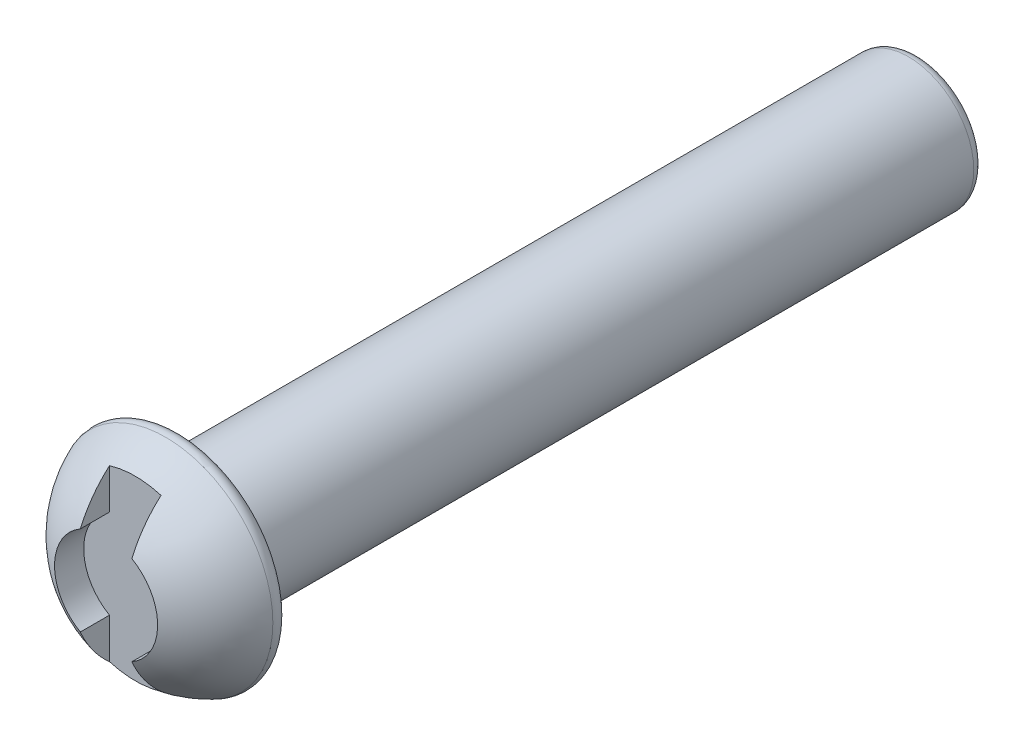
ISO-10303-21;
HEADER;
FILE_DESCRIPTION(('STEP AP214'),'2;1');
FILE_NAME('part.step','',(''),(''),'','','');
FILE_SCHEMA(('AUTOMOTIVE_DESIGN { 1 0 10303 214 1 1 1 1 }'));
ENDSEC;
DATA;
#1=APPLICATION_CONTEXT('core data for automotive mechanical design processes');
#2=APPLICATION_PROTOCOL_DEFINITION('international standard','automotive_design',2000,#1);
#3=PRODUCT_CONTEXT('',#1,'mechanical');
#4=PRODUCT('Part','Part','',(#3));
#5=PRODUCT_RELATED_PRODUCT_CATEGORY('part','',(#4));
#6=PRODUCT_DEFINITION_FORMATION('','',#4);
#7=PRODUCT_DEFINITION_CONTEXT('part definition',#1,'design');
#8=PRODUCT_DEFINITION('design','',#6,#7);
#9=PRODUCT_DEFINITION_SHAPE('','',#8);
#10=(LENGTH_UNIT() NAMED_UNIT(*) SI_UNIT(.MILLI.,.METRE.));
#11=(NAMED_UNIT(*) PLANE_ANGLE_UNIT() SI_UNIT($,.RADIAN.));
#12=(NAMED_UNIT(*) SI_UNIT($,.STERADIAN.) SOLID_ANGLE_UNIT());
#13=UNCERTAINTY_MEASURE_WITH_UNIT(LENGTH_MEASURE(1.E-05),#10,'distance_accuracy_value','');
#14=(GEOMETRIC_REPRESENTATION_CONTEXT(3) GLOBAL_UNCERTAINTY_ASSIGNED_CONTEXT((#13)) GLOBAL_UNIT_ASSIGNED_CONTEXT((#10,
#11,#12)) REPRESENTATION_CONTEXT('',''));
#15=CARTESIAN_POINT('',(0.,0.,0.));
#16=DIRECTION('',(0.,0.,1.));
#17=DIRECTION('',(1.,0.,0.));
#18=AXIS2_PLACEMENT_3D('',#15,#16,#17);
#19=CARTESIAN_POINT('',(0.,0.,-8.4388));
#20=DIRECTION('',(0.,0.,1.));
#21=DIRECTION('',(0.,1.,0.));
#22=AXIS2_PLACEMENT_3D('',#19,#20,#21);
#23=SPHERICAL_SURFACE('',#22,8.4388);
#24=CARTESIAN_POINT('',(-1.875,0.,-8.4388));
#25=DIRECTION('',(-1.,0.,0.));
#26=DIRECTION('',(0.,-1.,0.));
#27=AXIS2_PLACEMENT_3D('',#24,#25,#26);
#28=CIRCLE('',#27,8.22786244658963);
#29=CARTESIAN_POINT('',(-1.875,-6.17391083511902,-3.));
#30=VERTEX_POINT('',#29);
#31=CARTESIAN_POINT('',(-1.875,-3.24759526419164,-0.878982182089307));
#32=VERTEX_POINT('',#31);
#33=EDGE_CURVE('E144',#30,#32,#28,.T.);
#34=ORIENTED_EDGE('',*,*,#33,.T.);
#35=CARTESIAN_POINT('',(0.,0.,-0.878982182089307));
#36=DIRECTION('',(0.,0.,-1.));
#37=DIRECTION('',(-1.,0.,0.));
#38=AXIS2_PLACEMENT_3D('',#35,#36,#37);
#39=CIRCLE('',#38,3.75);
#40=CARTESIAN_POINT('',(-1.875,3.24759526419164,-0.878982182089307));
#41=VERTEX_POINT('',#40);
#42=EDGE_CURVE('E11',#32,#41,#39,.T.);
#43=ORIENTED_EDGE('',*,*,#42,.T.);
#44=CARTESIAN_POINT('',(-1.875,0.,-8.4388));
#45=DIRECTION('',(-1.,0.,0.));
#46=DIRECTION('',(0.,-1.,0.));
#47=AXIS2_PLACEMENT_3D('',#44,#45,#46);
#48=CIRCLE('',#47,8.22786244658963);
#49=CARTESIAN_POINT('',(-1.875,6.17391083511902,-3.));
#50=VERTEX_POINT('',#49);
#51=EDGE_CURVE('E41',#41,#50,#48,.T.);
#52=ORIENTED_EDGE('',*,*,#51,.T.);
#53=CARTESIAN_POINT('',(0.,0.,-3.));
#54=DIRECTION('',(0.,0.,1.));
#55=DIRECTION('',(1.,0.,0.));
#56=AXIS2_PLACEMENT_3D('',#53,#54,#55);
#57=CIRCLE('',#56,6.45234840968775);
#58=CARTESIAN_POINT('',(1.875,6.17391083511902,-3.));
#59=VERTEX_POINT('',#58);
#60=EDGE_CURVE('E137',#59,#50,#57,.T.);
#61=ORIENTED_EDGE('',*,*,#60,.F.);
#62=CARTESIAN_POINT('',(1.875,0.,-8.4388));
#63=DIRECTION('',(1.,0.,0.));
#64=DIRECTION('',(0.,1.,0.));
#65=AXIS2_PLACEMENT_3D('',#62,#63,#64);
#66=CIRCLE('',#65,8.22786244658964);
#67=CARTESIAN_POINT('',(1.875,3.24759526419165,-0.878982182089307));
#68=VERTEX_POINT('',#67);
#69=EDGE_CURVE('E141',#59,#68,#66,.T.);
#70=ORIENTED_EDGE('',*,*,#69,.T.);
#71=CARTESIAN_POINT('',(0.,0.,-0.878982182089307));
#72=DIRECTION('',(0.,0.,-1.));
#73=DIRECTION('',(-1.,0.,0.));
#74=AXIS2_PLACEMENT_3D('',#71,#72,#73);
#75=CIRCLE('',#74,3.75);
#76=CARTESIAN_POINT('',(1.875,-3.24759526419164,-0.878982182089306));
#77=VERTEX_POINT('',#76);
#78=EDGE_CURVE('E139',#68,#77,#75,.T.);
#79=ORIENTED_EDGE('',*,*,#78,.T.);
#80=CARTESIAN_POINT('',(1.875,0.,-8.4388));
#81=DIRECTION('',(1.,0.,0.));
#82=DIRECTION('',(0.,1.,0.));
#83=AXIS2_PLACEMENT_3D('',#80,#81,#82);
#84=CIRCLE('',#83,8.22786244658964);
#85=CARTESIAN_POINT('',(1.875,-6.17391083511902,-3.));
#86=VERTEX_POINT('',#85);
#87=EDGE_CURVE('E99',#77,#86,#84,.T.);
#88=ORIENTED_EDGE('',*,*,#87,.T.);
#89=EDGE_CURVE('E92',#30,#86,#57,.T.);
#90=ORIENTED_EDGE('',*,*,#89,.F.);
#91=EDGE_LOOP('',(#34,#43,#52,#61,#70,#79,#88,#90));
#92=FACE_BOUND('',#91,.T.);
#93=CARTESIAN_POINT('',(0.,0.,-5.21333628134429));
#94=DIRECTION('',(0.,0.,-1.));
#95=DIRECTION('',(-1.,0.,0.));
#96=AXIS2_PLACEMENT_3D('',#93,#94,#95);
#97=CIRCLE('',#96,7.79805932521904);
#98=CARTESIAN_POINT('',(-7.79805932521904,0.,-5.21333628134429));
#99=VERTEX_POINT('',#98);
#100=EDGE_CURVE('E130',#99,#99,#97,.F.);
#101=ORIENTED_EDGE('',*,*,#100,.T.);
#102=EDGE_LOOP('',(#101));
#103=FACE_BOUND('',#102,.T.);
#104=ADVANCED_FACE('F33',(#92,#103),#23,.T.);
#105=CARTESIAN_POINT('',(0.,0.,-60.));
#106=DIRECTION('',(0.,0.,1.));
#107=DIRECTION('',(1.,0.,0.));
#108=AXIS2_PLACEMENT_3D('',#105,#106,#107);
#109=PLANE('',#108);
#110=CARTESIAN_POINT('',(0.,0.,-60.));
#111=DIRECTION('',(0.,0.,1.));
#112=DIRECTION('',(1.,0.,0.));
#113=AXIS2_PLACEMENT_3D('',#110,#111,#112);
#114=CIRCLE('',#113,4.);
#115=CARTESIAN_POINT('',(4.,0.,-60.));
#116=VERTEX_POINT('',#115);
#117=EDGE_CURVE('E127',#116,#116,#114,.F.);
#118=ORIENTED_EDGE('',*,*,#117,.T.);
#119=EDGE_LOOP('',(#118));
#120=FACE_BOUND('',#119,.T.);
#121=ADVANCED_FACE('F169',(#120),#109,.F.);
#122=CARTESIAN_POINT('',(0.,0.,0.));
#123=DIRECTION('',(0.,0.,1.));
#124=DIRECTION('',(1.,0.,0.));
#125=AXIS2_PLACEMENT_3D('',#122,#123,#124);
#126=CYLINDRICAL_SURFACE('',#125,4.75);
#127=CARTESIAN_POINT('',(0.,0.,-59.25));
#128=DIRECTION('',(0.,0.,1.));
#129=DIRECTION('',(1.,0.,0.));
#130=AXIS2_PLACEMENT_3D('',#127,#128,#129);
#131=CIRCLE('',#130,4.75);
#132=CARTESIAN_POINT('',(4.75,0.,-59.25));
#133=VERTEX_POINT('',#132);
#134=EDGE_CURVE('E124',#133,#133,#131,.T.);
#135=ORIENTED_EDGE('',*,*,#134,.T.);
#136=EDGE_LOOP('',(#135));
#137=FACE_BOUND('',#136,.T.);
#138=CARTESIAN_POINT('',(0.,0.,-6.25));
#139=DIRECTION('',(0.,0.,1.));
#140=DIRECTION('',(1.,0.,0.));
#141=AXIS2_PLACEMENT_3D('',#138,#139,#140);
#142=CIRCLE('',#141,4.74999999999999);
#143=CARTESIAN_POINT('',(4.74999999999999,0.,-6.25));
#144=VERTEX_POINT('',#143);
#145=EDGE_CURVE('E118',#144,#144,#142,.T.);
#146=ORIENTED_EDGE('',*,*,#145,.F.);
#147=EDGE_LOOP('',(#146));
#148=FACE_BOUND('',#147,.T.);
#149=ADVANCED_FACE('F174',(#137,#148),#126,.T.);
#150=CARTESIAN_POINT('',(0.,4.74999999999999,-6.25));
#151=DIRECTION('',(0.,0.,1.));
#152=DIRECTION('',(1.,0.,0.));
#153=AXIS2_PLACEMENT_3D('',#150,#151,#152);
#154=PLANE('',#153);
#155=CARTESIAN_POINT('',(0.,0.,-6.25));
#156=DIRECTION('',(0.,0.,1.));
#157=DIRECTION('',(1.,0.,0.));
#158=AXIS2_PLACEMENT_3D('',#155,#156,#157);
#159=CIRCLE('',#158,7.1050052779713);
#160=CARTESIAN_POINT('',(7.1050052779713,0.,-6.25));
#161=VERTEX_POINT('',#160);
#162=EDGE_CURVE('E133',#161,#161,#159,.F.);
#163=ORIENTED_EDGE('',*,*,#162,.T.);
#164=EDGE_LOOP('',(#163));
#165=FACE_BOUND('',#164,.T.);
#166=ORIENTED_EDGE('',*,*,#145,.T.);
#167=EDGE_LOOP('',(#166));
#168=FACE_BOUND('',#167,.T.);
#169=ADVANCED_FACE('F180',(#165,#168),#154,.F.);
#170=CARTESIAN_POINT('',(0.,0.,-59.25));
#171=DIRECTION('',(0.,0.,1.));
#172=DIRECTION('',(1.,0.,0.));
#173=AXIS2_PLACEMENT_3D('',#170,#171,#172);
#174=TOROIDAL_SURFACE('',#173,4.,0.75);
#175=ORIENTED_EDGE('',*,*,#117,.F.);
#176=EDGE_LOOP('',(#175));
#177=FACE_BOUND('',#176,.T.);
#178=ORIENTED_EDGE('',*,*,#134,.F.);
#179=EDGE_LOOP('',(#178));
#180=FACE_BOUND('',#179,.T.);
#181=ADVANCED_FACE('F178',(#177,#180),#174,.T.);
#182=CARTESIAN_POINT('',(0.,0.,-5.5));
#183=DIRECTION('',(0.,0.,1.));
#184=DIRECTION('',(1.,0.,0.));
#185=AXIS2_PLACEMENT_3D('',#182,#183,#184);
#186=TOROIDAL_SURFACE('',#185,7.1050052779713,0.75);
#187=ORIENTED_EDGE('',*,*,#162,.F.);
#188=EDGE_LOOP('',(#187));
#189=FACE_BOUND('',#188,.T.);
#190=ORIENTED_EDGE('',*,*,#100,.F.);
#191=EDGE_LOOP('',(#190));
#192=FACE_BOUND('',#191,.T.);
#193=ADVANCED_FACE('F35',(#189,#192),#186,.T.);
#194=CARTESIAN_POINT('',(-1.875,-3.24759526419165,-3.));
#195=DIRECTION('',(-1.,0.,0.));
#196=DIRECTION('',(0.,-1.,0.));
#197=AXIS2_PLACEMENT_3D('',#194,#195,#196);
#198=PLANE('',#197);
#199=DIRECTION('',(0.,-1.,0.));
#200=VECTOR('',#199,1.);
#201=CARTESIAN_POINT('',(-1.875,-3.24759526419165,-3.));
#202=LINE('',#201,#200);
#203=CARTESIAN_POINT('',(-1.875,-3.24759526419164,-3.));
#204=VERTEX_POINT('',#203);
#205=EDGE_CURVE('E48',#204,#30,#202,.T.);
#206=ORIENTED_EDGE('',*,*,#205,.F.);
#207=DIRECTION('',(0.,0.,1.));
#208=VECTOR('',#207,1.);
#209=CARTESIAN_POINT('',(-1.875,-3.24759526419164,-3.));
#210=LINE('',#209,#208);
#211=EDGE_CURVE('E116',#204,#32,#210,.T.);
#212=ORIENTED_EDGE('',*,*,#211,.T.);
#213=ORIENTED_EDGE('',*,*,#33,.F.);
#214=EDGE_LOOP('',(#206,#212,#213));
#215=FACE_BOUND('',#214,.T.);
#216=ADVANCED_FACE('F156',(#215),#198,.F.);
#217=CARTESIAN_POINT('',(0.,0.,-3.));
#218=DIRECTION('',(0.,0.,1.));
#219=DIRECTION('',(1.,0.,0.));
#220=AXIS2_PLACEMENT_3D('',#217,#218,#219);
#221=CYLINDRICAL_SURFACE('',#220,3.75);
#222=ORIENTED_EDGE('',*,*,#211,.F.);
#223=CARTESIAN_POINT('',(0.,0.,-3.));
#224=DIRECTION('',(0.,0.,1.));
#225=DIRECTION('',(1.,0.,0.));
#226=AXIS2_PLACEMENT_3D('',#223,#224,#225);
#227=CIRCLE('',#226,3.75);
#228=CARTESIAN_POINT('',(-1.875,3.24759526419164,-3.));
#229=VERTEX_POINT('',#228);
#230=EDGE_CURVE('E113',#229,#204,#227,.T.);
#231=ORIENTED_EDGE('',*,*,#230,.F.);
#232=DIRECTION('',(0.,0.,1.));
#233=VECTOR('',#232,1.);
#234=CARTESIAN_POINT('',(-1.875,3.24759526419164,-3.));
#235=LINE('',#234,#233);
#236=EDGE_CURVE('E119',#229,#41,#235,.T.);
#237=ORIENTED_EDGE('',*,*,#236,.T.);
#238=ORIENTED_EDGE('',*,*,#42,.F.);
#239=EDGE_LOOP('',(#222,#231,#237,#238));
#240=FACE_BOUND('',#239,.T.);
#241=ADVANCED_FACE('F154',(#240),#221,.F.);
#242=CARTESIAN_POINT('',(-1.875,8.65297125420215,-3.));
#243=DIRECTION('',(-1.,0.,0.));
#244=DIRECTION('',(0.,-1.,0.));
#245=AXIS2_PLACEMENT_3D('',#242,#243,#244);
#246=PLANE('',#245);
#247=ORIENTED_EDGE('',*,*,#236,.F.);
#248=DIRECTION('',(0.,-1.,0.));
#249=VECTOR('',#248,1.);
#250=CARTESIAN_POINT('',(-1.875,8.65297125420215,-3.));
#251=LINE('',#250,#249);
#252=EDGE_CURVE('E109',#50,#229,#251,.T.);
#253=ORIENTED_EDGE('',*,*,#252,.F.);
#254=ORIENTED_EDGE('',*,*,#51,.F.);
#255=EDGE_LOOP('',(#247,#253,#254));
#256=FACE_BOUND('',#255,.T.);
#257=ADVANCED_FACE('F152',(#256),#246,.F.);
#258=CARTESIAN_POINT('',(1.875,8.65297125420215,-3.));
#259=DIRECTION('',(1.,0.,0.));
#260=DIRECTION('',(0.,1.,0.));
#261=AXIS2_PLACEMENT_3D('',#258,#259,#260);
#262=PLANE('',#261);
#263=DIRECTION('',(0.,1.,0.));
#264=VECTOR('',#263,1.);
#265=CARTESIAN_POINT('',(1.875,8.65297125420215,-3.));
#266=LINE('',#265,#264);
#267=CARTESIAN_POINT('',(1.875,3.24759526419165,-3.));
#268=VERTEX_POINT('',#267);
#269=EDGE_CURVE('E107',#268,#59,#266,.T.);
#270=ORIENTED_EDGE('',*,*,#269,.F.);
#271=DIRECTION('',(0.,0.,1.));
#272=VECTOR('',#271,1.);
#273=CARTESIAN_POINT('',(1.875,3.24759526419165,-3.));
#274=LINE('',#273,#272);
#275=EDGE_CURVE('E102',#268,#68,#274,.T.);
#276=ORIENTED_EDGE('',*,*,#275,.T.);
#277=ORIENTED_EDGE('',*,*,#69,.F.);
#278=EDGE_LOOP('',(#270,#276,#277));
#279=FACE_BOUND('',#278,.T.);
#280=ADVANCED_FACE('F159',(#279),#262,.F.);
#281=CARTESIAN_POINT('',(0.,0.,-3.));
#282=DIRECTION('',(0.,0.,1.));
#283=DIRECTION('',(1.,0.,0.));
#284=AXIS2_PLACEMENT_3D('',#281,#282,#283);
#285=CYLINDRICAL_SURFACE('',#284,3.75);
#286=ORIENTED_EDGE('',*,*,#275,.F.);
#287=CARTESIAN_POINT('',(0.,0.,-3.));
#288=DIRECTION('',(0.,0.,1.));
#289=DIRECTION('',(1.,0.,0.));
#290=AXIS2_PLACEMENT_3D('',#287,#288,#289);
#291=CIRCLE('',#290,3.75);
#292=CARTESIAN_POINT('',(1.875,-3.24759526419164,-3.));
#293=VERTEX_POINT('',#292);
#294=EDGE_CURVE('E90',#293,#268,#291,.T.);
#295=ORIENTED_EDGE('',*,*,#294,.F.);
#296=DIRECTION('',(0.,0.,1.));
#297=VECTOR('',#296,1.);
#298=CARTESIAN_POINT('',(1.875,-3.24759526419164,-3.));
#299=LINE('',#298,#297);
#300=EDGE_CURVE('E97',#293,#77,#299,.T.);
#301=ORIENTED_EDGE('',*,*,#300,.T.);
#302=ORIENTED_EDGE('',*,*,#78,.F.);
#303=EDGE_LOOP('',(#286,#295,#301,#302));
#304=FACE_BOUND('',#303,.T.);
#305=ADVANCED_FACE('F104',(#304),#285,.F.);
#306=CARTESIAN_POINT('',(1.875,-3.24759526419164,-3.));
#307=DIRECTION('',(1.,0.,0.));
#308=DIRECTION('',(0.,1.,0.));
#309=AXIS2_PLACEMENT_3D('',#306,#307,#308);
#310=PLANE('',#309);
#311=ORIENTED_EDGE('',*,*,#300,.F.);
#312=DIRECTION('',(0.,1.,0.));
#313=VECTOR('',#312,1.);
#314=CARTESIAN_POINT('',(1.875,-3.24759526419164,-3.));
#315=LINE('',#314,#313);
#316=EDGE_CURVE('E85',#86,#293,#315,.T.);
#317=ORIENTED_EDGE('',*,*,#316,.F.);
#318=ORIENTED_EDGE('',*,*,#87,.F.);
#319=EDGE_LOOP('',(#311,#317,#318));
#320=FACE_BOUND('',#319,.T.);
#321=ADVANCED_FACE('F98',(#320),#310,.F.);
#322=CARTESIAN_POINT('',(0.,0.,-3.));
#323=DIRECTION('',(0.,0.,1.));
#324=DIRECTION('',(1.,0.,0.));
#325=AXIS2_PLACEMENT_3D('',#322,#323,#324);
#326=PLANE('',#325);
#327=ORIENTED_EDGE('',*,*,#60,.T.);
#328=ORIENTED_EDGE('',*,*,#252,.T.);
#329=ORIENTED_EDGE('',*,*,#230,.T.);
#330=ORIENTED_EDGE('',*,*,#205,.T.);
#331=ORIENTED_EDGE('',*,*,#89,.T.);
#332=ORIENTED_EDGE('',*,*,#316,.T.);
#333=ORIENTED_EDGE('',*,*,#294,.T.);
#334=ORIENTED_EDGE('',*,*,#269,.T.);
#335=EDGE_LOOP('',(#327,#328,#329,#330,#331,#332,#333,#334));
#336=FACE_BOUND('',#335,.T.);
#337=ADVANCED_FACE('F87',(#336),#326,.T.);
#338=CLOSED_SHELL('',(#104,#121,#149,#169,#181,#193,#216,#241,#257,#280,#305,#321,#337));
#339=MANIFOLD_SOLID_BREP('B2',#338);
#340=ADVANCED_BREP_SHAPE_REPRESENTATION('',(#18,#339),#14);
#341=SHAPE_DEFINITION_REPRESENTATION(#9,#340);
ENDSEC;
END-ISO-10303-21;
